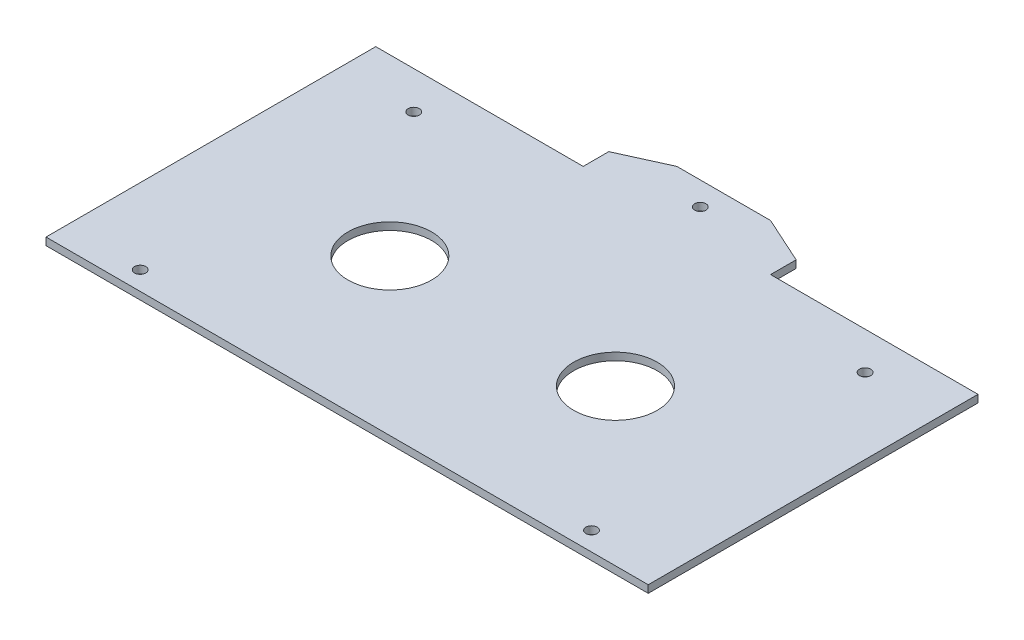
ISO-10303-21;
HEADER;
FILE_DESCRIPTION(('STEP AP214'),'2;1');
FILE_NAME('part.step','',(''),(''),'','','');
FILE_SCHEMA(('AUTOMOTIVE_DESIGN { 1 0 10303 214 1 1 1 1 }'));
ENDSEC;
DATA;
#1=APPLICATION_CONTEXT('core data for automotive mechanical design processes');
#2=APPLICATION_PROTOCOL_DEFINITION('international standard','automotive_design',2000,#1);
#3=PRODUCT_CONTEXT('',#1,'mechanical');
#4=PRODUCT('Part','Part','',(#3));
#5=PRODUCT_RELATED_PRODUCT_CATEGORY('part','',(#4));
#6=PRODUCT_DEFINITION_FORMATION('','',#4);
#7=PRODUCT_DEFINITION_CONTEXT('part definition',#1,'design');
#8=PRODUCT_DEFINITION('design','',#6,#7);
#9=PRODUCT_DEFINITION_SHAPE('','',#8);
#10=(LENGTH_UNIT() NAMED_UNIT(*) SI_UNIT(.MILLI.,.METRE.));
#11=(NAMED_UNIT(*) PLANE_ANGLE_UNIT() SI_UNIT($,.RADIAN.));
#12=(NAMED_UNIT(*) SI_UNIT($,.STERADIAN.) SOLID_ANGLE_UNIT());
#13=UNCERTAINTY_MEASURE_WITH_UNIT(LENGTH_MEASURE(1.E-05),#10,'distance_accuracy_value','');
#14=(GEOMETRIC_REPRESENTATION_CONTEXT(3) GLOBAL_UNCERTAINTY_ASSIGNED_CONTEXT((#13)) GLOBAL_UNIT_ASSIGNED_CONTEXT((#10,
#11,#12)) REPRESENTATION_CONTEXT('',''));
#15=CARTESIAN_POINT('',(0.,0.,0.));
#16=DIRECTION('',(0.,0.,1.));
#17=DIRECTION('',(1.,0.,0.));
#18=AXIS2_PLACEMENT_3D('',#15,#16,#17);
#19=CARTESIAN_POINT('',(0.,2.,-44.));
#20=DIRECTION('',(0.,0.,1.));
#21=DIRECTION('',(1.,0.,0.));
#22=AXIS2_PLACEMENT_3D('',#19,#20,#21);
#23=PLANE('',#22);
#24=DIRECTION('',(0.,1.,0.));
#25=VECTOR('',#24,1.);
#26=CARTESIAN_POINT('',(-79.1797078460986,-64.4999999999999,-44.));
#27=LINE('',#26,#25);
#28=CARTESIAN_POINT('',(-79.1797078460986,0.,-44.));
#29=VERTEX_POINT('',#28);
#30=CARTESIAN_POINT('',(-79.1797078460986,2.,-44.));
#31=VERTEX_POINT('',#30);
#32=EDGE_CURVE('E61',#29,#31,#27,.T.);
#33=ORIENTED_EDGE('',*,*,#32,.T.);
#34=DIRECTION('',(-1.,0.,0.));
#35=VECTOR('',#34,1.);
#36=CARTESIAN_POINT('',(0.,2.,-44.));
#37=LINE('',#36,#35);
#38=CARTESIAN_POINT('',(-23.8283042472908,2.,-44.));
#39=VERTEX_POINT('',#38);
#40=EDGE_CURVE('E143',#39,#31,#37,.T.);
#41=ORIENTED_EDGE('',*,*,#40,.F.);
#42=DIRECTION('',(0.,1.,0.));
#43=VECTOR('',#42,1.);
#44=CARTESIAN_POINT('',(-23.8283042472908,-51.5375899441171,-44.));
#45=LINE('',#44,#43);
#46=CARTESIAN_POINT('',(-23.8283042472908,0.,-44.));
#47=VERTEX_POINT('',#46);
#48=EDGE_CURVE('E209',#47,#39,#45,.T.);
#49=ORIENTED_EDGE('',*,*,#48,.F.);
#50=DIRECTION('',(-1.,0.,0.));
#51=VECTOR('',#50,1.);
#52=CARTESIAN_POINT('',(0.,0.,-44.));
#53=LINE('',#52,#51);
#54=EDGE_CURVE('E167',#47,#29,#53,.T.);
#55=ORIENTED_EDGE('',*,*,#54,.T.);
#56=EDGE_LOOP('',(#33,#41,#49,#55));
#57=FACE_BOUND('',#56,.T.);
#58=ADVANCED_FACE('F46',(#57),#23,.F.);
#59=CARTESIAN_POINT('',(0.,2.,44.));
#60=DIRECTION('',(0.,0.,-1.));
#61=DIRECTION('',(-1.,0.,0.));
#62=AXIS2_PLACEMENT_3D('',#59,#60,#61);
#63=PLANE('',#62);
#64=DIRECTION('',(1.,0.,0.));
#65=VECTOR('',#64,1.);
#66=CARTESIAN_POINT('',(0.,0.,44.));
#67=LINE('',#66,#65);
#68=CARTESIAN_POINT('',(-79.1797078460986,0.,44.));
#69=VERTEX_POINT('',#68);
#70=CARTESIAN_POINT('',(81.523099351517,0.,44.));
#71=VERTEX_POINT('',#70);
#72=EDGE_CURVE('E166',#69,#71,#67,.T.);
#73=ORIENTED_EDGE('',*,*,#72,.T.);
#74=DIRECTION('',(0.,1.,0.));
#75=VECTOR('',#74,1.);
#76=CARTESIAN_POINT('',(81.523099351517,-64.4999999999999,44.));
#77=LINE('',#76,#75);
#78=CARTESIAN_POINT('',(81.523099351517,2.,44.));
#79=VERTEX_POINT('',#78);
#80=EDGE_CURVE('E69',#71,#79,#77,.T.);
#81=ORIENTED_EDGE('',*,*,#80,.T.);
#82=DIRECTION('',(1.,0.,0.));
#83=VECTOR('',#82,1.);
#84=CARTESIAN_POINT('',(0.,2.,44.));
#85=LINE('',#84,#83);
#86=CARTESIAN_POINT('',(-79.1797078460986,2.,44.));
#87=VERTEX_POINT('',#86);
#88=EDGE_CURVE('E137',#87,#79,#85,.T.);
#89=ORIENTED_EDGE('',*,*,#88,.F.);
#90=DIRECTION('',(0.,1.,0.));
#91=VECTOR('',#90,1.);
#92=CARTESIAN_POINT('',(-79.1797078460986,-64.4999999999999,44.));
#93=LINE('',#92,#91);
#94=EDGE_CURVE('E138',#69,#87,#93,.T.);
#95=ORIENTED_EDGE('',*,*,#94,.F.);
#96=EDGE_LOOP('',(#73,#81,#89,#95));
#97=FACE_BOUND('',#96,.T.);
#98=ADVANCED_FACE('F194',(#97),#63,.F.);
#99=CARTESIAN_POINT('',(0.,2.,0.));
#100=DIRECTION('',(0.,1.,0.));
#101=DIRECTION('',(0.,0.,1.));
#102=AXIS2_PLACEMENT_3D('',#99,#100,#101);
#103=PLANE('',#102);
#104=DIRECTION('',(0.,0.,1.));
#105=VECTOR('',#104,1.);
#106=CARTESIAN_POINT('',(81.523099351517,2.,0.));
#107=LINE('',#106,#105);
#108=CARTESIAN_POINT('',(81.523099351517,2.,-44.));
#109=VERTEX_POINT('',#108);
#110=EDGE_CURVE('E123',#109,#79,#107,.T.);
#111=ORIENTED_EDGE('',*,*,#110,.F.);
#112=CARTESIAN_POINT('',(26.1716957527092,2.,-44.));
#113=VERTEX_POINT('',#112);
#114=EDGE_CURVE('E133',#109,#113,#37,.T.);
#115=ORIENTED_EDGE('',*,*,#114,.T.);
#116=DIRECTION('',(0.,0.,-1.));
#117=VECTOR('',#116,1.);
#118=CARTESIAN_POINT('',(26.1716957527092,2.,-44.));
#119=LINE('',#118,#117);
#120=CARTESIAN_POINT('',(26.1716957527092,2.,-50.823606938333));
#121=VERTEX_POINT('',#120);
#122=EDGE_CURVE('E207',#113,#121,#119,.T.);
#123=ORIENTED_EDGE('',*,*,#122,.T.);
#124=DIRECTION('',(-0.910654396943774,0.,-0.413168935578379));
#125=VECTOR('',#124,1.);
#126=CARTESIAN_POINT('',(26.1716957527092,2.,-50.823606938333));
#127=LINE('',#126,#125);
#128=CARTESIAN_POINT('',(13.6716957527092,2.,-56.4949260601234));
#129=VERTEX_POINT('',#128);
#130=EDGE_CURVE('E254',#121,#129,#127,.T.);
#131=ORIENTED_EDGE('',*,*,#130,.T.);
#132=DIRECTION('',(-1.,0.,0.));
#133=VECTOR('',#132,1.);
#134=CARTESIAN_POINT('',(13.6716957527092,2.,-56.4949260601234));
#135=LINE('',#134,#133);
#136=CARTESIAN_POINT('',(-11.3283042472908,2.,-56.4949260601235));
#137=VERTEX_POINT('',#136);
#138=EDGE_CURVE('E261',#129,#137,#135,.T.);
#139=ORIENTED_EDGE('',*,*,#138,.T.);
#140=DIRECTION('',(-0.910654396943774,0.,0.413168935578379));
#141=VECTOR('',#140,1.);
#142=CARTESIAN_POINT('',(-11.3283042472908,2.,-56.4949260601235));
#143=LINE('',#142,#141);
#144=CARTESIAN_POINT('',(-23.8283042472908,2.,-50.823606938333));
#145=VERTEX_POINT('',#144);
#146=EDGE_CURVE('E263',#137,#145,#143,.T.);
#147=ORIENTED_EDGE('',*,*,#146,.T.);
#148=DIRECTION('',(0.,0.,1.));
#149=VECTOR('',#148,1.);
#150=CARTESIAN_POINT('',(-23.8283042472908,2.,-50.823606938333));
#151=LINE('',#150,#149);
#152=EDGE_CURVE('E217',#145,#39,#151,.T.);
#153=ORIENTED_EDGE('',*,*,#152,.T.);
#154=ORIENTED_EDGE('',*,*,#40,.T.);
#155=DIRECTION('',(0.,0.,1.));
#156=VECTOR('',#155,1.);
#157=CARTESIAN_POINT('',(-79.1797078460986,2.,0.));
#158=LINE('',#157,#156);
#159=EDGE_CURVE('E281',#31,#87,#158,.T.);
#160=ORIENTED_EDGE('',*,*,#159,.T.);
#161=ORIENTED_EDGE('',*,*,#88,.T.);
#162=EDGE_LOOP('',(#111,#115,#123,#131,#139,#147,#153,#154,#160,#161));
#163=FACE_BOUND('',#162,.T.);
#164=CARTESIAN_POINT('',(-28.9351848900761,2.,2.5));
#165=DIRECTION('',(0.,1.,0.));
#166=DIRECTION('',(0.,0.,1.));
#167=AXIS2_PLACEMENT_3D('',#164,#165,#166);
#168=CIRCLE('',#167,11.15);
#169=CARTESIAN_POINT('',(-28.9351848900761,2.,13.65));
#170=VERTEX_POINT('',#169);
#171=EDGE_CURVE('E185',#170,#170,#168,.T.);
#172=ORIENTED_EDGE('',*,*,#171,.F.);
#173=EDGE_LOOP('',(#172));
#174=FACE_BOUND('',#173,.T.);
#175=CARTESIAN_POINT('',(31.2785763954945,2.,2.5));
#176=DIRECTION('',(0.,1.,0.));
#177=DIRECTION('',(0.,0.,1.));
#178=AXIS2_PLACEMENT_3D('',#175,#176,#177);
#179=CIRCLE('',#178,11.15);
#180=CARTESIAN_POINT('',(31.2785763954945,2.,13.65));
#181=VERTEX_POINT('',#180);
#182=EDGE_CURVE('E150',#181,#181,#179,.T.);
#183=ORIENTED_EDGE('',*,*,#182,.F.);
#184=EDGE_LOOP('',(#183));
#185=FACE_BOUND('',#184,.T.);
#186=CARTESIAN_POINT('',(61.3854570382798,2.,39.));
#187=DIRECTION('',(0.,1.,0.));
#188=DIRECTION('',(0.,0.,1.));
#189=AXIS2_PLACEMENT_3D('',#186,#187,#188);
#190=CIRCLE('',#189,1.5);
#191=CARTESIAN_POINT('',(61.3854570382798,2.,40.5));
#192=VERTEX_POINT('',#191);
#193=EDGE_CURVE('E145',#192,#192,#190,.T.);
#194=ORIENTED_EDGE('',*,*,#193,.F.);
#195=EDGE_LOOP('',(#194));
#196=FACE_BOUND('',#195,.T.);
#197=CARTESIAN_POINT('',(-59.0420655328614,2.,39.));
#198=DIRECTION('',(0.,1.,0.));
#199=DIRECTION('',(0.,0.,1.));
#200=AXIS2_PLACEMENT_3D('',#197,#198,#199);
#201=CIRCLE('',#200,1.5);
#202=CARTESIAN_POINT('',(-59.0420655328614,2.,40.5));
#203=VERTEX_POINT('',#202);
#204=EDGE_CURVE('E155',#203,#203,#201,.T.);
#205=ORIENTED_EDGE('',*,*,#204,.F.);
#206=EDGE_LOOP('',(#205));
#207=FACE_BOUND('',#206,.T.);
#208=CARTESIAN_POINT('',(-59.0420655328614,2.,-34.));
#209=DIRECTION('',(0.,1.,0.));
#210=DIRECTION('',(0.,0.,1.));
#211=AXIS2_PLACEMENT_3D('',#208,#209,#210);
#212=CIRCLE('',#211,1.5);
#213=CARTESIAN_POINT('',(-59.0420655328614,2.,-32.5));
#214=VERTEX_POINT('',#213);
#215=EDGE_CURVE('E158',#214,#214,#212,.T.);
#216=ORIENTED_EDGE('',*,*,#215,.F.);
#217=EDGE_LOOP('',(#216));
#218=FACE_BOUND('',#217,.T.);
#219=CARTESIAN_POINT('',(61.3854570382798,2.,-34.));
#220=DIRECTION('',(0.,1.,0.));
#221=DIRECTION('',(0.,0.,1.));
#222=AXIS2_PLACEMENT_3D('',#219,#220,#221);
#223=CIRCLE('',#222,1.5);
#224=CARTESIAN_POINT('',(61.3854570382798,2.,-32.5));
#225=VERTEX_POINT('',#224);
#226=EDGE_CURVE('E161',#225,#225,#223,.T.);
#227=ORIENTED_EDGE('',*,*,#226,.F.);
#228=EDGE_LOOP('',(#227));
#229=FACE_BOUND('',#228,.T.);
#230=CARTESIAN_POINT('',(1.17169575270919,2.,-50.2474630300617));
#231=DIRECTION('',(0.,1.,0.));
#232=DIRECTION('',(0.,0.,1.));
#233=AXIS2_PLACEMENT_3D('',#230,#231,#232);
#234=CIRCLE('',#233,1.5);
#235=CARTESIAN_POINT('',(1.17169575270919,2.,-48.7474630300617));
#236=VERTEX_POINT('',#235);
#237=EDGE_CURVE('E251',#236,#236,#234,.T.);
#238=ORIENTED_EDGE('',*,*,#237,.F.);
#239=EDGE_LOOP('',(#238));
#240=FACE_BOUND('',#239,.T.);
#241=ADVANCED_FACE('F130',(#163,#174,#185,#196,#207,#218,#229,#240),#103,.T.);
#242=CARTESIAN_POINT('',(0.,0.,0.));
#243=DIRECTION('',(0.,1.,0.));
#244=DIRECTION('',(0.,0.,1.));
#245=AXIS2_PLACEMENT_3D('',#242,#243,#244);
#246=PLANE('',#245);
#247=CARTESIAN_POINT('',(1.17169575270919,0.,-50.2474630300617));
#248=DIRECTION('',(0.,1.,0.));
#249=DIRECTION('',(0.,0.,1.));
#250=AXIS2_PLACEMENT_3D('',#247,#248,#249);
#251=CIRCLE('',#250,1.5);
#252=CARTESIAN_POINT('',(1.17169575270919,0.,-48.7474630300617));
#253=VERTEX_POINT('',#252);
#254=EDGE_CURVE('E227',#253,#253,#251,.F.);
#255=ORIENTED_EDGE('',*,*,#254,.F.);
#256=EDGE_LOOP('',(#255));
#257=FACE_BOUND('',#256,.T.);
#258=CARTESIAN_POINT('',(61.3854570382798,0.,-34.));
#259=DIRECTION('',(0.,1.,0.));
#260=DIRECTION('',(0.,0.,1.));
#261=AXIS2_PLACEMENT_3D('',#258,#259,#260);
#262=CIRCLE('',#261,1.5);
#263=CARTESIAN_POINT('',(61.3854570382798,0.,-32.5));
#264=VERTEX_POINT('',#263);
#265=EDGE_CURVE('E148',#264,#264,#262,.T.);
#266=ORIENTED_EDGE('',*,*,#265,.T.);
#267=EDGE_LOOP('',(#266));
#268=FACE_BOUND('',#267,.T.);
#269=CARTESIAN_POINT('',(-59.0420655328614,0.,-34.));
#270=DIRECTION('',(0.,1.,0.));
#271=DIRECTION('',(0.,0.,1.));
#272=AXIS2_PLACEMENT_3D('',#269,#270,#271);
#273=CIRCLE('',#272,1.5);
#274=CARTESIAN_POINT('',(-59.0420655328614,0.,-32.5));
#275=VERTEX_POINT('',#274);
#276=EDGE_CURVE('E176',#275,#275,#273,.T.);
#277=ORIENTED_EDGE('',*,*,#276,.T.);
#278=EDGE_LOOP('',(#277));
#279=FACE_BOUND('',#278,.T.);
#280=CARTESIAN_POINT('',(-59.0420655328614,0.,39.));
#281=DIRECTION('',(0.,1.,0.));
#282=DIRECTION('',(0.,0.,1.));
#283=AXIS2_PLACEMENT_3D('',#280,#281,#282);
#284=CIRCLE('',#283,1.5);
#285=CARTESIAN_POINT('',(-59.0420655328614,0.,40.5));
#286=VERTEX_POINT('',#285);
#287=EDGE_CURVE('E173',#286,#286,#284,.T.);
#288=ORIENTED_EDGE('',*,*,#287,.T.);
#289=EDGE_LOOP('',(#288));
#290=FACE_BOUND('',#289,.T.);
#291=CARTESIAN_POINT('',(61.3854570382798,0.,39.));
#292=DIRECTION('',(0.,1.,0.));
#293=DIRECTION('',(0.,0.,1.));
#294=AXIS2_PLACEMENT_3D('',#291,#292,#293);
#295=CIRCLE('',#294,1.5);
#296=CARTESIAN_POINT('',(61.3854570382798,0.,40.5));
#297=VERTEX_POINT('',#296);
#298=EDGE_CURVE('E170',#297,#297,#295,.T.);
#299=ORIENTED_EDGE('',*,*,#298,.T.);
#300=EDGE_LOOP('',(#299));
#301=FACE_BOUND('',#300,.T.);
#302=CARTESIAN_POINT('',(31.2785763954945,0.,2.5));
#303=DIRECTION('',(0.,1.,0.));
#304=DIRECTION('',(0.,0.,1.));
#305=AXIS2_PLACEMENT_3D('',#302,#303,#304);
#306=CIRCLE('',#305,11.15);
#307=CARTESIAN_POINT('',(31.2785763954945,0.,13.65));
#308=VERTEX_POINT('',#307);
#309=EDGE_CURVE('E181',#308,#308,#306,.T.);
#310=ORIENTED_EDGE('',*,*,#309,.T.);
#311=EDGE_LOOP('',(#310));
#312=FACE_BOUND('',#311,.T.);
#313=CARTESIAN_POINT('',(-28.9351848900761,0.,2.5));
#314=DIRECTION('',(0.,1.,0.));
#315=DIRECTION('',(0.,0.,1.));
#316=AXIS2_PLACEMENT_3D('',#313,#314,#315);
#317=CIRCLE('',#316,11.15);
#318=CARTESIAN_POINT('',(-28.9351848900761,0.,13.65));
#319=VERTEX_POINT('',#318);
#320=EDGE_CURVE('E184',#319,#319,#317,.T.);
#321=ORIENTED_EDGE('',*,*,#320,.T.);
#322=EDGE_LOOP('',(#321));
#323=FACE_BOUND('',#322,.T.);
#324=CARTESIAN_POINT('',(81.523099351517,0.,-44.));
#325=VERTEX_POINT('',#324);
#326=CARTESIAN_POINT('',(26.1716957527092,0.,-44.));
#327=VERTEX_POINT('',#326);
#328=EDGE_CURVE('E164',#325,#327,#53,.T.);
#329=ORIENTED_EDGE('',*,*,#328,.F.);
#330=DIRECTION('',(0.,0.,1.));
#331=VECTOR('',#330,1.);
#332=CARTESIAN_POINT('',(81.523099351517,0.,0.));
#333=LINE('',#332,#331);
#334=EDGE_CURVE('E11',#325,#71,#333,.T.);
#335=ORIENTED_EDGE('',*,*,#334,.T.);
#336=ORIENTED_EDGE('',*,*,#72,.F.);
#337=DIRECTION('',(0.,0.,1.));
#338=VECTOR('',#337,1.);
#339=CARTESIAN_POINT('',(-79.1797078460986,0.,0.));
#340=LINE('',#339,#338);
#341=EDGE_CURVE('E54',#29,#69,#340,.T.);
#342=ORIENTED_EDGE('',*,*,#341,.F.);
#343=ORIENTED_EDGE('',*,*,#54,.F.);
#344=DIRECTION('',(0.,0.,-1.));
#345=VECTOR('',#344,1.);
#346=CARTESIAN_POINT('',(-23.8283042472908,0.,-50.823606938333));
#347=LINE('',#346,#345);
#348=CARTESIAN_POINT('',(-23.8283042472908,0.,-50.823606938333));
#349=VERTEX_POINT('',#348);
#350=EDGE_CURVE('E204',#47,#349,#347,.T.);
#351=ORIENTED_EDGE('',*,*,#350,.T.);
#352=DIRECTION('',(0.910654396943774,0.,-0.413168935578379));
#353=VECTOR('',#352,1.);
#354=CARTESIAN_POINT('',(-11.3283042472908,0.,-56.4949260601235));
#355=LINE('',#354,#353);
#356=CARTESIAN_POINT('',(-11.3283042472908,0.,-56.4949260601235));
#357=VERTEX_POINT('',#356);
#358=EDGE_CURVE('E211',#349,#357,#355,.T.);
#359=ORIENTED_EDGE('',*,*,#358,.T.);
#360=DIRECTION('',(1.,0.,0.));
#361=VECTOR('',#360,1.);
#362=CARTESIAN_POINT('',(13.6716957527092,0.,-56.4949260601234));
#363=LINE('',#362,#361);
#364=CARTESIAN_POINT('',(13.6716957527092,0.,-56.4949260601234));
#365=VERTEX_POINT('',#364);
#366=EDGE_CURVE('E208',#357,#365,#363,.T.);
#367=ORIENTED_EDGE('',*,*,#366,.T.);
#368=DIRECTION('',(0.910654396943774,0.,0.413168935578379));
#369=VECTOR('',#368,1.);
#370=CARTESIAN_POINT('',(26.1716957527092,0.,-50.823606938333));
#371=LINE('',#370,#369);
#372=CARTESIAN_POINT('',(26.1716957527092,0.,-50.823606938333));
#373=VERTEX_POINT('',#372);
#374=EDGE_CURVE('E201',#365,#373,#371,.T.);
#375=ORIENTED_EDGE('',*,*,#374,.T.);
#376=DIRECTION('',(0.,0.,1.));
#377=VECTOR('',#376,1.);
#378=CARTESIAN_POINT('',(26.1716957527092,0.,-44.));
#379=LINE('',#378,#377);
#380=EDGE_CURVE('E199',#373,#327,#379,.T.);
#381=ORIENTED_EDGE('',*,*,#380,.T.);
#382=EDGE_LOOP('',(#329,#335,#336,#342,#343,#351,#359,#367,#375,#381));
#383=FACE_BOUND('',#382,.T.);
#384=ADVANCED_FACE('F196',(#257,#268,#279,#290,#301,#312,#323,#383),#246,.F.);
#385=ORIENTED_EDGE('',*,*,#114,.F.);
#386=DIRECTION('',(0.,1.,0.));
#387=VECTOR('',#386,1.);
#388=CARTESIAN_POINT('',(81.523099351517,-64.4999999999999,-44.));
#389=LINE('',#388,#387);
#390=EDGE_CURVE('E120',#325,#109,#389,.T.);
#391=ORIENTED_EDGE('',*,*,#390,.F.);
#392=ORIENTED_EDGE('',*,*,#328,.T.);
#393=DIRECTION('',(0.,1.,0.));
#394=VECTOR('',#393,1.);
#395=CARTESIAN_POINT('',(26.1716957527092,-51.5375899441171,-44.));
#396=LINE('',#395,#394);
#397=EDGE_CURVE('E141',#327,#113,#396,.T.);
#398=ORIENTED_EDGE('',*,*,#397,.T.);
#399=EDGE_LOOP('',(#385,#391,#392,#398));
#400=FACE_BOUND('',#399,.T.);
#401=ADVANCED_FACE('F48',(#400),#23,.F.);
#402=CARTESIAN_POINT('',(-59.0420655328614,2.,-34.));
#403=DIRECTION('',(0.,-1.,0.));
#404=DIRECTION('',(0.,0.,-1.));
#405=AXIS2_PLACEMENT_3D('',#402,#403,#404);
#406=CYLINDRICAL_SURFACE('',#405,1.5);
#407=ORIENTED_EDGE('',*,*,#215,.T.);
#408=EDGE_LOOP('',(#407));
#409=FACE_BOUND('',#408,.T.);
#410=ORIENTED_EDGE('',*,*,#276,.F.);
#411=EDGE_LOOP('',(#410));
#412=FACE_BOUND('',#411,.T.);
#413=ADVANCED_FACE('F305',(#409,#412),#406,.F.);
#414=CARTESIAN_POINT('',(-59.0420655328614,2.,39.));
#415=DIRECTION('',(0.,-1.,0.));
#416=DIRECTION('',(0.,0.,-1.));
#417=AXIS2_PLACEMENT_3D('',#414,#415,#416);
#418=CYLINDRICAL_SURFACE('',#417,1.5);
#419=ORIENTED_EDGE('',*,*,#204,.T.);
#420=EDGE_LOOP('',(#419));
#421=FACE_BOUND('',#420,.T.);
#422=ORIENTED_EDGE('',*,*,#287,.F.);
#423=EDGE_LOOP('',(#422));
#424=FACE_BOUND('',#423,.T.);
#425=ADVANCED_FACE('F310',(#421,#424),#418,.F.);
#426=CARTESIAN_POINT('',(61.3854570382798,2.,39.));
#427=DIRECTION('',(0.,-1.,0.));
#428=DIRECTION('',(0.,0.,-1.));
#429=AXIS2_PLACEMENT_3D('',#426,#427,#428);
#430=CYLINDRICAL_SURFACE('',#429,1.5);
#431=ORIENTED_EDGE('',*,*,#193,.T.);
#432=EDGE_LOOP('',(#431));
#433=FACE_BOUND('',#432,.T.);
#434=ORIENTED_EDGE('',*,*,#298,.F.);
#435=EDGE_LOOP('',(#434));
#436=FACE_BOUND('',#435,.T.);
#437=ADVANCED_FACE('F323',(#433,#436),#430,.F.);
#438=CARTESIAN_POINT('',(61.3854570382798,2.,-34.));
#439=DIRECTION('',(0.,-1.,0.));
#440=DIRECTION('',(0.,0.,-1.));
#441=AXIS2_PLACEMENT_3D('',#438,#439,#440);
#442=CYLINDRICAL_SURFACE('',#441,1.5);
#443=ORIENTED_EDGE('',*,*,#226,.T.);
#444=EDGE_LOOP('',(#443));
#445=FACE_BOUND('',#444,.T.);
#446=ORIENTED_EDGE('',*,*,#265,.F.);
#447=EDGE_LOOP('',(#446));
#448=FACE_BOUND('',#447,.T.);
#449=ADVANCED_FACE('F321',(#445,#448),#442,.F.);
#450=CARTESIAN_POINT('',(31.2785763954945,-8.,2.5));
#451=DIRECTION('',(0.,1.,0.));
#452=DIRECTION('',(0.,0.,1.));
#453=AXIS2_PLACEMENT_3D('',#450,#451,#452);
#454=CYLINDRICAL_SURFACE('',#453,11.15);
#455=ORIENTED_EDGE('',*,*,#182,.T.);
#456=EDGE_LOOP('',(#455));
#457=FACE_BOUND('',#456,.T.);
#458=ORIENTED_EDGE('',*,*,#309,.F.);
#459=EDGE_LOOP('',(#458));
#460=FACE_BOUND('',#459,.T.);
#461=ADVANCED_FACE('F235',(#457,#460),#454,.F.);
#462=CARTESIAN_POINT('',(-28.9351848900761,-8.,2.5));
#463=DIRECTION('',(0.,1.,0.));
#464=DIRECTION('',(0.,0.,1.));
#465=AXIS2_PLACEMENT_3D('',#462,#463,#464);
#466=CYLINDRICAL_SURFACE('',#465,11.15);
#467=ORIENTED_EDGE('',*,*,#171,.T.);
#468=EDGE_LOOP('',(#467));
#469=FACE_BOUND('',#468,.T.);
#470=ORIENTED_EDGE('',*,*,#320,.F.);
#471=EDGE_LOOP('',(#470));
#472=FACE_BOUND('',#471,.T.);
#473=ADVANCED_FACE('F291',(#469,#472),#466,.F.);
#474=CARTESIAN_POINT('',(26.1716957527092,-51.5375899441171,-50.823606938333));
#475=DIRECTION('',(0.413168935578379,0.,-0.910654396943774));
#476=DIRECTION('',(-0.910654396943774,0.,-0.413168935578379));
#477=AXIS2_PLACEMENT_3D('',#474,#475,#476);
#478=PLANE('',#477);
#479=ORIENTED_EDGE('',*,*,#374,.F.);
#480=DIRECTION('',(0.,1.,0.));
#481=VECTOR('',#480,1.);
#482=CARTESIAN_POINT('',(13.6716957527092,-51.5375899441171,-56.4949260601234));
#483=LINE('',#482,#481);
#484=EDGE_CURVE('E223',#365,#129,#483,.T.);
#485=ORIENTED_EDGE('',*,*,#484,.T.);
#486=ORIENTED_EDGE('',*,*,#130,.F.);
#487=DIRECTION('',(0.,1.,0.));
#488=VECTOR('',#487,1.);
#489=CARTESIAN_POINT('',(26.1716957527092,-51.5375899441171,-50.823606938333));
#490=LINE('',#489,#488);
#491=EDGE_CURVE('E225',#373,#121,#490,.T.);
#492=ORIENTED_EDGE('',*,*,#491,.F.);
#493=EDGE_LOOP('',(#479,#485,#486,#492));
#494=FACE_BOUND('',#493,.T.);
#495=ADVANCED_FACE('F289',(#494),#478,.T.);
#496=CARTESIAN_POINT('',(13.6716957527092,-51.5375899441171,-56.4949260601234));
#497=DIRECTION('',(0.,0.,-1.));
#498=DIRECTION('',(-1.,0.,0.));
#499=AXIS2_PLACEMENT_3D('',#496,#497,#498);
#500=PLANE('',#499);
#501=ORIENTED_EDGE('',*,*,#366,.F.);
#502=DIRECTION('',(0.,1.,0.));
#503=VECTOR('',#502,1.);
#504=CARTESIAN_POINT('',(-11.3283042472908,-51.5375899441171,-56.4949260601235));
#505=LINE('',#504,#503);
#506=EDGE_CURVE('E221',#357,#137,#505,.T.);
#507=ORIENTED_EDGE('',*,*,#506,.T.);
#508=ORIENTED_EDGE('',*,*,#138,.F.);
#509=ORIENTED_EDGE('',*,*,#484,.F.);
#510=EDGE_LOOP('',(#501,#507,#508,#509));
#511=FACE_BOUND('',#510,.T.);
#512=ADVANCED_FACE('F285',(#511),#500,.T.);
#513=CARTESIAN_POINT('',(-11.3283042472908,-51.5375899441171,-56.4949260601235));
#514=DIRECTION('',(-0.413168935578379,0.,-0.910654396943774));
#515=DIRECTION('',(-0.910654396943774,0.,0.413168935578379));
#516=AXIS2_PLACEMENT_3D('',#513,#514,#515);
#517=PLANE('',#516);
#518=ORIENTED_EDGE('',*,*,#358,.F.);
#519=DIRECTION('',(0.,1.,0.));
#520=VECTOR('',#519,1.);
#521=CARTESIAN_POINT('',(-23.8283042472908,-51.5375899441171,-50.823606938333));
#522=LINE('',#521,#520);
#523=EDGE_CURVE('E214',#349,#145,#522,.T.);
#524=ORIENTED_EDGE('',*,*,#523,.T.);
#525=ORIENTED_EDGE('',*,*,#146,.F.);
#526=ORIENTED_EDGE('',*,*,#506,.F.);
#527=EDGE_LOOP('',(#518,#524,#525,#526));
#528=FACE_BOUND('',#527,.T.);
#529=ADVANCED_FACE('F277',(#528),#517,.T.);
#530=CARTESIAN_POINT('',(-23.8283042472908,-51.5375899441171,-50.823606938333));
#531=DIRECTION('',(-1.,0.,0.));
#532=DIRECTION('',(0.,0.,1.));
#533=AXIS2_PLACEMENT_3D('',#530,#531,#532);
#534=PLANE('',#533);
#535=ORIENTED_EDGE('',*,*,#350,.F.);
#536=ORIENTED_EDGE('',*,*,#48,.T.);
#537=ORIENTED_EDGE('',*,*,#152,.F.);
#538=ORIENTED_EDGE('',*,*,#523,.F.);
#539=EDGE_LOOP('',(#535,#536,#537,#538));
#540=FACE_BOUND('',#539,.T.);
#541=ADVANCED_FACE('F271',(#540),#534,.T.);
#542=CARTESIAN_POINT('',(26.1716957527092,-51.5375899441171,-44.));
#543=DIRECTION('',(1.,0.,0.));
#544=DIRECTION('',(0.,0.,-1.));
#545=AXIS2_PLACEMENT_3D('',#542,#543,#544);
#546=PLANE('',#545);
#547=ORIENTED_EDGE('',*,*,#380,.F.);
#548=ORIENTED_EDGE('',*,*,#491,.T.);
#549=ORIENTED_EDGE('',*,*,#122,.F.);
#550=ORIENTED_EDGE('',*,*,#397,.F.);
#551=EDGE_LOOP('',(#547,#548,#549,#550));
#552=FACE_BOUND('',#551,.T.);
#553=ADVANCED_FACE('F206',(#552),#546,.T.);
#554=CARTESIAN_POINT('',(1.17169575270919,-51.5375899441171,-50.2474630300617));
#555=DIRECTION('',(0.,1.,0.));
#556=DIRECTION('',(0.,0.,1.));
#557=AXIS2_PLACEMENT_3D('',#554,#555,#556);
#558=CYLINDRICAL_SURFACE('',#557,1.5);
#559=ORIENTED_EDGE('',*,*,#254,.T.);
#560=EDGE_LOOP('',(#559));
#561=FACE_BOUND('',#560,.T.);
#562=ORIENTED_EDGE('',*,*,#237,.T.);
#563=EDGE_LOOP('',(#562));
#564=FACE_BOUND('',#563,.T.);
#565=ADVANCED_FACE('F345',(#561,#564),#558,.F.);
#566=CARTESIAN_POINT('',(-79.1797078460986,-64.4999999999999,0.));
#567=DIRECTION('',(-1.,0.,0.));
#568=DIRECTION('',(0.,0.,1.));
#569=AXIS2_PLACEMENT_3D('',#566,#567,#568);
#570=PLANE('',#569);
#571=ORIENTED_EDGE('',*,*,#341,.T.);
#572=ORIENTED_EDGE('',*,*,#94,.T.);
#573=ORIENTED_EDGE('',*,*,#159,.F.);
#574=ORIENTED_EDGE('',*,*,#32,.F.);
#575=EDGE_LOOP('',(#571,#572,#573,#574));
#576=FACE_BOUND('',#575,.T.);
#577=ADVANCED_FACE('F188',(#576),#570,.T.);
#578=CARTESIAN_POINT('',(81.523099351517,-64.4999999999999,0.));
#579=DIRECTION('',(-1.,0.,0.));
#580=DIRECTION('',(0.,0.,1.));
#581=AXIS2_PLACEMENT_3D('',#578,#579,#580);
#582=PLANE('',#581);
#583=ORIENTED_EDGE('',*,*,#390,.T.);
#584=ORIENTED_EDGE('',*,*,#110,.T.);
#585=ORIENTED_EDGE('',*,*,#80,.F.);
#586=ORIENTED_EDGE('',*,*,#334,.F.);
#587=EDGE_LOOP('',(#583,#584,#585,#586));
#588=FACE_BOUND('',#587,.T.);
#589=ADVANCED_FACE('F122',(#588),#582,.F.);
#590=CLOSED_SHELL('',(#58,#98,#241,#384,#401,#413,#425,#437,#449,#461,#473,#495,#512,#529,#541,
#553,#565,#577,#589));
#591=MANIFOLD_SOLID_BREP('B2',#590);
#592=ADVANCED_BREP_SHAPE_REPRESENTATION('',(#18,#591),#14);
#593=SHAPE_DEFINITION_REPRESENTATION(#9,#592);
ENDSEC;
END-ISO-10303-21;
